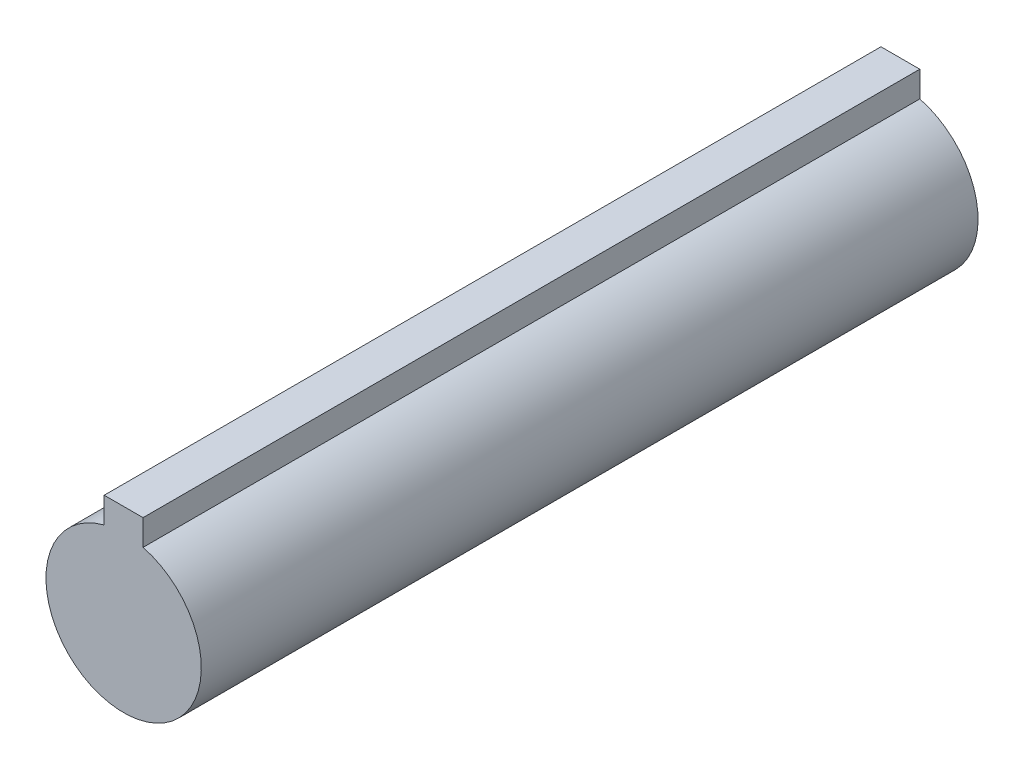
ISO-10303-21;
HEADER;
FILE_DESCRIPTION(('STEP AP214'),'2;1');
FILE_NAME('part.step','',(''),(''),'','','');
FILE_SCHEMA(('AUTOMOTIVE_DESIGN { 1 0 10303 214 1 1 1 1 }'));
ENDSEC;
DATA;
#1=APPLICATION_CONTEXT('core data for automotive mechanical design processes');
#2=APPLICATION_PROTOCOL_DEFINITION('international standard','automotive_design',2000,#1);
#3=PRODUCT_CONTEXT('',#1,'mechanical');
#4=PRODUCT('Part','Part','',(#3));
#5=PRODUCT_RELATED_PRODUCT_CATEGORY('part','',(#4));
#6=PRODUCT_DEFINITION_FORMATION('','',#4);
#7=PRODUCT_DEFINITION_CONTEXT('part definition',#1,'design');
#8=PRODUCT_DEFINITION('design','',#6,#7);
#9=PRODUCT_DEFINITION_SHAPE('','',#8);
#10=(LENGTH_UNIT() NAMED_UNIT(*) SI_UNIT(.MILLI.,.METRE.));
#11=(NAMED_UNIT(*) PLANE_ANGLE_UNIT() SI_UNIT($,.RADIAN.));
#12=(NAMED_UNIT(*) SI_UNIT($,.STERADIAN.) SOLID_ANGLE_UNIT());
#13=UNCERTAINTY_MEASURE_WITH_UNIT(LENGTH_MEASURE(1.E-05),#10,'distance_accuracy_value','');
#14=(GEOMETRIC_REPRESENTATION_CONTEXT(3) GLOBAL_UNCERTAINTY_ASSIGNED_CONTEXT((#13)) GLOBAL_UNIT_ASSIGNED_CONTEXT((#10,
#11,#12)) REPRESENTATION_CONTEXT('',''));
#15=CARTESIAN_POINT('',(0.,0.,0.));
#16=DIRECTION('',(0.,0.,1.));
#17=DIRECTION('',(1.,0.,0.));
#18=AXIS2_PLACEMENT_3D('',#15,#16,#17);
#19=CARTESIAN_POINT('',(0.,0.,50.));
#20=DIRECTION('',(0.,0.,-1.));
#21=DIRECTION('',(-1.,0.,0.));
#22=AXIS2_PLACEMENT_3D('',#19,#20,#21);
#23=CYLINDRICAL_SURFACE('',#22,9.99999999999999);
#24=CARTESIAN_POINT('',(0.,0.,-50.));
#25=DIRECTION('',(0.,0.,1.));
#26=DIRECTION('',(1.,0.,0.));
#27=AXIS2_PLACEMENT_3D('',#24,#25,#26);
#28=CIRCLE('',#27,9.99999999999999);
#29=CARTESIAN_POINT('',(-2.5,9.68245836551854,-50.));
#30=VERTEX_POINT('',#29);
#31=CARTESIAN_POINT('',(2.5,9.68245836551854,-50.));
#32=VERTEX_POINT('',#31);
#33=EDGE_CURVE('E96',#30,#32,#28,.T.);
#34=ORIENTED_EDGE('',*,*,#33,.T.);
#35=DIRECTION('',(0.,0.,-1.));
#36=VECTOR('',#35,1.);
#37=CARTESIAN_POINT('',(2.5,9.68245836551854,50.));
#38=LINE('',#37,#36);
#39=CARTESIAN_POINT('',(2.5,9.68245836551854,50.));
#40=VERTEX_POINT('',#39);
#41=EDGE_CURVE('E11',#40,#32,#38,.T.);
#42=ORIENTED_EDGE('',*,*,#41,.F.);
#43=CARTESIAN_POINT('',(0.,0.,50.));
#44=DIRECTION('',(0.,0.,1.));
#45=DIRECTION('',(1.,0.,0.));
#46=AXIS2_PLACEMENT_3D('',#43,#44,#45);
#47=CIRCLE('',#46,9.99999999999999);
#48=CARTESIAN_POINT('',(-2.5,9.68245836551854,50.));
#49=VERTEX_POINT('',#48);
#50=EDGE_CURVE('E84',#49,#40,#47,.T.);
#51=ORIENTED_EDGE('',*,*,#50,.F.);
#52=DIRECTION('',(0.,0.,-1.));
#53=VECTOR('',#52,1.);
#54=CARTESIAN_POINT('',(-2.5,9.68245836551854,50.));
#55=LINE('',#54,#53);
#56=EDGE_CURVE('E92',#49,#30,#55,.T.);
#57=ORIENTED_EDGE('',*,*,#56,.T.);
#58=EDGE_LOOP('',(#34,#42,#51,#57));
#59=FACE_BOUND('',#58,.T.);
#60=ADVANCED_FACE('F33',(#59),#23,.T.);
#61=CARTESIAN_POINT('',(2.5,9.68245836551854,50.));
#62=DIRECTION('',(-1.,0.,0.));
#63=DIRECTION('',(0.,-1.,0.));
#64=AXIS2_PLACEMENT_3D('',#61,#62,#63);
#65=PLANE('',#64);
#66=DIRECTION('',(0.,1.,0.));
#67=VECTOR('',#66,1.);
#68=CARTESIAN_POINT('',(2.5,9.68245836551854,-50.));
#69=LINE('',#68,#67);
#70=CARTESIAN_POINT('',(2.5,13.,-50.));
#71=VERTEX_POINT('',#70);
#72=EDGE_CURVE('E88',#32,#71,#69,.T.);
#73=ORIENTED_EDGE('',*,*,#72,.T.);
#74=DIRECTION('',(0.,0.,-1.));
#75=VECTOR('',#74,1.);
#76=CARTESIAN_POINT('',(2.5,13.,50.));
#77=LINE('',#76,#75);
#78=CARTESIAN_POINT('',(2.5,13.,50.));
#79=VERTEX_POINT('',#78);
#80=EDGE_CURVE('E41',#79,#71,#77,.T.);
#81=ORIENTED_EDGE('',*,*,#80,.F.);
#82=DIRECTION('',(0.,1.,0.));
#83=VECTOR('',#82,1.);
#84=CARTESIAN_POINT('',(2.5,9.68245836551854,50.));
#85=LINE('',#84,#83);
#86=EDGE_CURVE('E79',#40,#79,#85,.T.);
#87=ORIENTED_EDGE('',*,*,#86,.F.);
#88=ORIENTED_EDGE('',*,*,#41,.T.);
#89=EDGE_LOOP('',(#73,#81,#87,#88));
#90=FACE_BOUND('',#89,.T.);
#91=ADVANCED_FACE('F87',(#90),#65,.F.);
#92=CARTESIAN_POINT('',(-2.5,13.,50.));
#93=DIRECTION('',(0.,-1.,0.));
#94=DIRECTION('',(0.,0.,-1.));
#95=AXIS2_PLACEMENT_3D('',#92,#93,#94);
#96=PLANE('',#95);
#97=DIRECTION('',(-1.,0.,0.));
#98=VECTOR('',#97,1.);
#99=CARTESIAN_POINT('',(-2.5,13.,-50.));
#100=LINE('',#99,#98);
#101=CARTESIAN_POINT('',(-2.5,13.,-50.));
#102=VERTEX_POINT('',#101);
#103=EDGE_CURVE('E66',#71,#102,#100,.T.);
#104=ORIENTED_EDGE('',*,*,#103,.T.);
#105=DIRECTION('',(0.,0.,-1.));
#106=VECTOR('',#105,1.);
#107=CARTESIAN_POINT('',(-2.5,13.,50.));
#108=LINE('',#107,#106);
#109=CARTESIAN_POINT('',(-2.5,13.,50.));
#110=VERTEX_POINT('',#109);
#111=EDGE_CURVE('E89',#110,#102,#108,.T.);
#112=ORIENTED_EDGE('',*,*,#111,.F.);
#113=DIRECTION('',(-1.,0.,0.));
#114=VECTOR('',#113,1.);
#115=CARTESIAN_POINT('',(-2.5,13.,50.));
#116=LINE('',#115,#114);
#117=EDGE_CURVE('E82',#79,#110,#116,.T.);
#118=ORIENTED_EDGE('',*,*,#117,.F.);
#119=ORIENTED_EDGE('',*,*,#80,.T.);
#120=EDGE_LOOP('',(#104,#112,#118,#119));
#121=FACE_BOUND('',#120,.T.);
#122=ADVANCED_FACE('F90',(#121),#96,.F.);
#123=CARTESIAN_POINT('',(-2.5,9.68245836551854,50.));
#124=DIRECTION('',(1.,0.,0.));
#125=DIRECTION('',(0.,1.,0.));
#126=AXIS2_PLACEMENT_3D('',#123,#124,#125);
#127=PLANE('',#126);
#128=DIRECTION('',(0.,-1.,0.));
#129=VECTOR('',#128,1.);
#130=CARTESIAN_POINT('',(-2.5,9.68245836551854,-50.));
#131=LINE('',#130,#129);
#132=EDGE_CURVE('E72',#102,#30,#131,.T.);
#133=ORIENTED_EDGE('',*,*,#132,.T.);
#134=ORIENTED_EDGE('',*,*,#56,.F.);
#135=DIRECTION('',(0.,-1.,0.));
#136=VECTOR('',#135,1.);
#137=CARTESIAN_POINT('',(-2.5,9.68245836551854,50.));
#138=LINE('',#137,#136);
#139=EDGE_CURVE('E49',#110,#49,#138,.T.);
#140=ORIENTED_EDGE('',*,*,#139,.F.);
#141=ORIENTED_EDGE('',*,*,#111,.T.);
#142=EDGE_LOOP('',(#133,#134,#140,#141));
#143=FACE_BOUND('',#142,.T.);
#144=ADVANCED_FACE('F103',(#143),#127,.F.);
#145=CARTESIAN_POINT('',(0.,0.,50.));
#146=DIRECTION('',(0.,0.,1.));
#147=DIRECTION('',(1.,0.,0.));
#148=AXIS2_PLACEMENT_3D('',#145,#146,#147);
#149=PLANE('',#148);
#150=ORIENTED_EDGE('',*,*,#50,.T.);
#151=ORIENTED_EDGE('',*,*,#86,.T.);
#152=ORIENTED_EDGE('',*,*,#117,.T.);
#153=ORIENTED_EDGE('',*,*,#139,.T.);
#154=EDGE_LOOP('',(#150,#151,#152,#153));
#155=FACE_BOUND('',#154,.T.);
#156=ADVANCED_FACE('F80',(#155),#149,.T.);
#157=CARTESIAN_POINT('',(0.,0.,-50.));
#158=DIRECTION('',(0.,0.,1.));
#159=DIRECTION('',(1.,0.,0.));
#160=AXIS2_PLACEMENT_3D('',#157,#158,#159);
#161=PLANE('',#160);
#162=ORIENTED_EDGE('',*,*,#33,.F.);
#163=ORIENTED_EDGE('',*,*,#132,.F.);
#164=ORIENTED_EDGE('',*,*,#103,.F.);
#165=ORIENTED_EDGE('',*,*,#72,.F.);
#166=EDGE_LOOP('',(#162,#163,#164,#165));
#167=FACE_BOUND('',#166,.T.);
#168=ADVANCED_FACE('F106',(#167),#161,.F.);
#169=CLOSED_SHELL('',(#60,#91,#122,#144,#156,#168));
#170=MANIFOLD_SOLID_BREP('B2',#169);
#171=ADVANCED_BREP_SHAPE_REPRESENTATION('',(#18,#170),#14);
#172=SHAPE_DEFINITION_REPRESENTATION(#9,#171);
ENDSEC;
END-ISO-10303-21;
